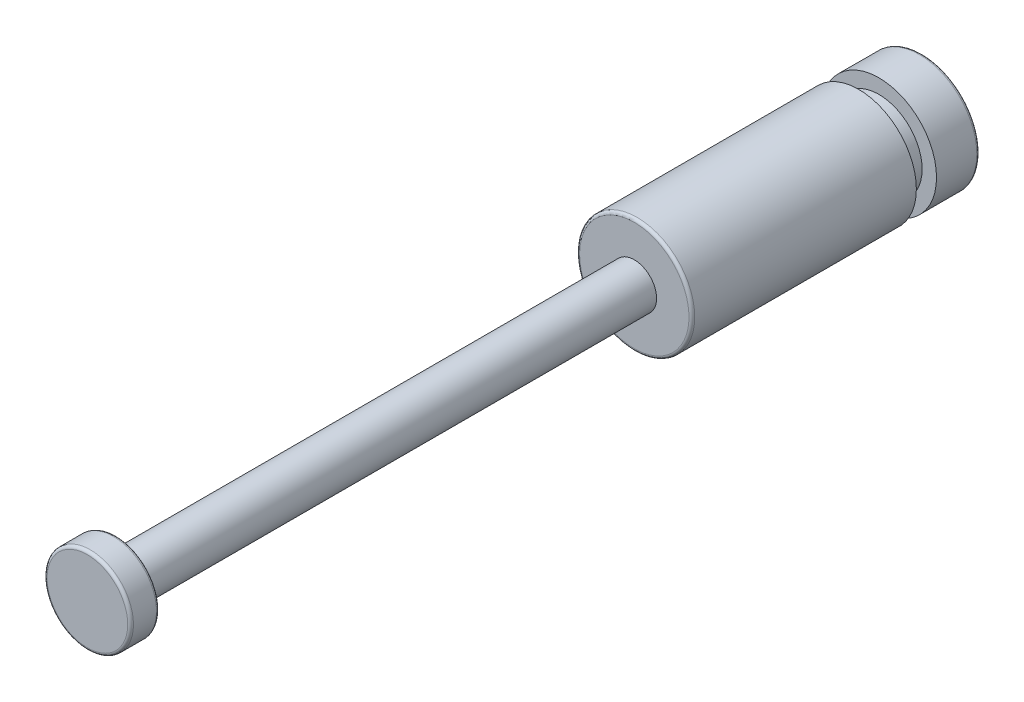
ISO-10303-21;
HEADER;
FILE_DESCRIPTION(('STEP AP214'),'2;1');
FILE_NAME('part.step','',(''),(''),'','','');
FILE_SCHEMA(('AUTOMOTIVE_DESIGN { 1 0 10303 214 1 1 1 1 }'));
ENDSEC;
DATA;
#1=APPLICATION_CONTEXT('core data for automotive mechanical design processes');
#2=APPLICATION_PROTOCOL_DEFINITION('international standard','automotive_design',2000,#1);
#3=PRODUCT_CONTEXT('',#1,'mechanical');
#4=PRODUCT('Part','Part','',(#3));
#5=PRODUCT_RELATED_PRODUCT_CATEGORY('part','',(#4));
#6=PRODUCT_DEFINITION_FORMATION('','',#4);
#7=PRODUCT_DEFINITION_CONTEXT('part definition',#1,'design');
#8=PRODUCT_DEFINITION('design','',#6,#7);
#9=PRODUCT_DEFINITION_SHAPE('','',#8);
#10=(LENGTH_UNIT() NAMED_UNIT(*) SI_UNIT(.MILLI.,.METRE.));
#11=(NAMED_UNIT(*) PLANE_ANGLE_UNIT() SI_UNIT($,.RADIAN.));
#12=(NAMED_UNIT(*) SI_UNIT($,.STERADIAN.) SOLID_ANGLE_UNIT());
#13=UNCERTAINTY_MEASURE_WITH_UNIT(LENGTH_MEASURE(1.E-05),#10,'distance_accuracy_value','');
#14=(GEOMETRIC_REPRESENTATION_CONTEXT(3) GLOBAL_UNCERTAINTY_ASSIGNED_CONTEXT((#13)) GLOBAL_UNIT_ASSIGNED_CONTEXT((#10,
#11,#12)) REPRESENTATION_CONTEXT('',''));
#15=CARTESIAN_POINT('',(0.,0.,0.));
#16=DIRECTION('',(0.,0.,1.));
#17=DIRECTION('',(1.,0.,0.));
#18=AXIS2_PLACEMENT_3D('',#15,#16,#17);
#19=CARTESIAN_POINT('',(0.,0.,-10.));
#20=DIRECTION('',(0.,0.,1.));
#21=DIRECTION('',(1.,0.,0.));
#22=AXIS2_PLACEMENT_3D('',#19,#20,#21);
#23=CYLINDRICAL_SURFACE('',#22,2.);
#24=CARTESIAN_POINT('',(0.,0.,-0.0999999999999994));
#25=DIRECTION('',(0.,0.,-1.));
#26=DIRECTION('',(-1.,0.,0.));
#27=AXIS2_PLACEMENT_3D('',#24,#25,#26);
#28=CIRCLE('',#27,2.);
#29=CARTESIAN_POINT('',(-2.,0.,-0.0999999999999994));
#30=VERTEX_POINT('',#29);
#31=EDGE_CURVE('E56',#30,#30,#28,.T.);
#32=ORIENTED_EDGE('',*,*,#31,.T.);
#33=EDGE_LOOP('',(#32));
#34=FACE_BOUND('',#33,.T.);
#35=CARTESIAN_POINT('',(0.,0.,-7.8));
#36=DIRECTION('',(0.,0.,1.));
#37=DIRECTION('',(1.,0.,0.));
#38=AXIS2_PLACEMENT_3D('',#35,#36,#37);
#39=CIRCLE('',#38,2.);
#40=CARTESIAN_POINT('',(2.,0.,-7.8));
#41=VERTEX_POINT('',#40);
#42=EDGE_CURVE('E94',#41,#41,#39,.T.);
#43=ORIENTED_EDGE('',*,*,#42,.T.);
#44=EDGE_LOOP('',(#43));
#45=FACE_BOUND('',#44,.T.);
#46=ADVANCED_FACE('F34',(#34,#45),#23,.T.);
#47=CARTESIAN_POINT('',(0.,0.,18.));
#48=DIRECTION('',(0.,0.,-1.));
#49=DIRECTION('',(-1.,0.,0.));
#50=AXIS2_PLACEMENT_3D('',#47,#48,#49);
#51=CYLINDRICAL_SURFACE('',#50,0.775000000000001);
#52=CARTESIAN_POINT('',(0.,0.,18.));
#53=DIRECTION('',(0.,0.,1.));
#54=DIRECTION('',(1.,0.,0.));
#55=AXIS2_PLACEMENT_3D('',#52,#53,#54);
#56=CIRCLE('',#55,0.775000000000001);
#57=CARTESIAN_POINT('',(0.775000000000001,0.,18.));
#58=VERTEX_POINT('',#57);
#59=EDGE_CURVE('E74',#58,#58,#56,.T.);
#60=ORIENTED_EDGE('',*,*,#59,.F.);
#61=EDGE_LOOP('',(#60));
#62=FACE_BOUND('',#61,.T.);
#63=CARTESIAN_POINT('',(0.,0.,0.));
#64=DIRECTION('',(0.,0.,-1.));
#65=DIRECTION('',(-1.,0.,0.));
#66=AXIS2_PLACEMENT_3D('',#63,#64,#65);
#67=CIRCLE('',#66,0.775000000000001);
#68=CARTESIAN_POINT('',(-0.775000000000001,0.,0.));
#69=VERTEX_POINT('',#68);
#70=EDGE_CURVE('E78',#69,#69,#67,.T.);
#71=ORIENTED_EDGE('',*,*,#70,.F.);
#72=EDGE_LOOP('',(#71));
#73=FACE_BOUND('',#72,.T.);
#74=ADVANCED_FACE('F118',(#62,#73),#51,.T.);
#75=CARTESIAN_POINT('',(0.,0.,18.));
#76=DIRECTION('',(0.,0.,1.));
#77=DIRECTION('',(1.,0.,0.));
#78=AXIS2_PLACEMENT_3D('',#75,#76,#77);
#79=PLANE('',#78);
#80=CARTESIAN_POINT('',(0.,0.,18.));
#81=DIRECTION('',(0.,0.,1.));
#82=DIRECTION('',(1.,0.,0.));
#83=AXIS2_PLACEMENT_3D('',#80,#81,#82);
#84=CIRCLE('',#83,1.4);
#85=CARTESIAN_POINT('',(1.4,0.,18.));
#86=VERTEX_POINT('',#85);
#87=EDGE_CURVE('E65',#86,#86,#84,.F.);
#88=ORIENTED_EDGE('',*,*,#87,.T.);
#89=EDGE_LOOP('',(#88));
#90=FACE_BOUND('',#89,.T.);
#91=ORIENTED_EDGE('',*,*,#59,.T.);
#92=EDGE_LOOP('',(#91));
#93=FACE_BOUND('',#92,.T.);
#94=ADVANCED_FACE('F125',(#90,#93),#79,.F.);
#95=CARTESIAN_POINT('',(0.,0.,19.));
#96=DIRECTION('',(0.,0.,-1.));
#97=DIRECTION('',(-1.,0.,0.));
#98=AXIS2_PLACEMENT_3D('',#95,#96,#97);
#99=CYLINDRICAL_SURFACE('',#98,1.5);
#100=CARTESIAN_POINT('',(0.,0.,18.1));
#101=DIRECTION('',(0.,0.,1.));
#102=DIRECTION('',(1.,0.,0.));
#103=AXIS2_PLACEMENT_3D('',#100,#101,#102);
#104=CIRCLE('',#103,1.5);
#105=CARTESIAN_POINT('',(1.5,0.,18.1));
#106=VERTEX_POINT('',#105);
#107=EDGE_CURVE('E68',#106,#106,#104,.T.);
#108=ORIENTED_EDGE('',*,*,#107,.T.);
#109=EDGE_LOOP('',(#108));
#110=FACE_BOUND('',#109,.T.);
#111=CARTESIAN_POINT('',(0.,0.,18.9));
#112=DIRECTION('',(0.,0.,1.));
#113=DIRECTION('',(1.,0.,0.));
#114=AXIS2_PLACEMENT_3D('',#111,#112,#113);
#115=CIRCLE('',#114,1.5);
#116=CARTESIAN_POINT('',(1.5,0.,18.9));
#117=VERTEX_POINT('',#116);
#118=EDGE_CURVE('E71',#117,#117,#115,.F.);
#119=ORIENTED_EDGE('',*,*,#118,.T.);
#120=EDGE_LOOP('',(#119));
#121=FACE_BOUND('',#120,.T.);
#122=ADVANCED_FACE('F234',(#110,#121),#99,.T.);
#123=CARTESIAN_POINT('',(0.,0.,19.));
#124=DIRECTION('',(0.,0.,1.));
#125=DIRECTION('',(1.,0.,0.));
#126=AXIS2_PLACEMENT_3D('',#123,#124,#125);
#127=PLANE('',#126);
#128=CARTESIAN_POINT('',(0.,0.,19.));
#129=DIRECTION('',(0.,0.,1.));
#130=DIRECTION('',(1.,0.,0.));
#131=AXIS2_PLACEMENT_3D('',#128,#129,#130);
#132=CIRCLE('',#131,1.4);
#133=CARTESIAN_POINT('',(1.4,0.,19.));
#134=VERTEX_POINT('',#133);
#135=EDGE_CURVE('E62',#134,#134,#132,.T.);
#136=ORIENTED_EDGE('',*,*,#135,.T.);
#137=EDGE_LOOP('',(#136));
#138=FACE_BOUND('',#137,.T.);
#139=ADVANCED_FACE('F113',(#138),#127,.T.);
#140=CARTESIAN_POINT('',(0.,0.,0.));
#141=DIRECTION('',(0.,0.,-1.));
#142=DIRECTION('',(-1.,0.,0.));
#143=AXIS2_PLACEMENT_3D('',#140,#141,#142);
#144=PLANE('',#143);
#145=CARTESIAN_POINT('',(0.,0.,0.));
#146=DIRECTION('',(0.,0.,-1.));
#147=DIRECTION('',(-1.,0.,0.));
#148=AXIS2_PLACEMENT_3D('',#145,#146,#147);
#149=CIRCLE('',#148,1.9);
#150=CARTESIAN_POINT('',(-1.9,0.,0.));
#151=VERTEX_POINT('',#150);
#152=EDGE_CURVE('E49',#151,#151,#149,.F.);
#153=ORIENTED_EDGE('',*,*,#152,.T.);
#154=EDGE_LOOP('',(#153));
#155=FACE_BOUND('',#154,.T.);
#156=ORIENTED_EDGE('',*,*,#70,.T.);
#157=EDGE_LOOP('',(#156));
#158=FACE_BOUND('',#157,.T.);
#159=ADVANCED_FACE('F103',(#155,#158),#144,.F.);
#160=CARTESIAN_POINT('',(0.,2.,-7.8));
#161=DIRECTION('',(0.,0.,-1.));
#162=DIRECTION('',(-1.,0.,0.));
#163=AXIS2_PLACEMENT_3D('',#160,#161,#162);
#164=PLANE('',#163);
#165=CARTESIAN_POINT('',(0.,0.,-7.8));
#166=DIRECTION('',(0.,0.,1.));
#167=DIRECTION('',(1.,0.,0.));
#168=AXIS2_PLACEMENT_3D('',#165,#166,#167);
#169=CIRCLE('',#168,1.5);
#170=CARTESIAN_POINT('',(1.5,0.,-7.8));
#171=VERTEX_POINT('',#170);
#172=EDGE_CURVE('E82',#171,#171,#169,.T.);
#173=ORIENTED_EDGE('',*,*,#172,.T.);
#174=EDGE_LOOP('',(#173));
#175=FACE_BOUND('',#174,.T.);
#176=ORIENTED_EDGE('',*,*,#42,.F.);
#177=EDGE_LOOP('',(#176));
#178=FACE_BOUND('',#177,.T.);
#179=ADVANCED_FACE('F100',(#175,#178),#164,.T.);
#180=CARTESIAN_POINT('',(0.,0.,0.));
#181=DIRECTION('',(0.,0.,1.));
#182=DIRECTION('',(1.,0.,0.));
#183=AXIS2_PLACEMENT_3D('',#180,#181,#182);
#184=CYLINDRICAL_SURFACE('',#183,1.5);
#185=CARTESIAN_POINT('',(0.,0.,-8.5));
#186=DIRECTION('',(0.,0.,1.));
#187=DIRECTION('',(1.,0.,0.));
#188=AXIS2_PLACEMENT_3D('',#185,#186,#187);
#189=CIRCLE('',#188,1.5);
#190=CARTESIAN_POINT('',(1.5,0.,-8.5));
#191=VERTEX_POINT('',#190);
#192=EDGE_CURVE('E86',#191,#191,#189,.T.);
#193=ORIENTED_EDGE('',*,*,#192,.T.);
#194=EDGE_LOOP('',(#193));
#195=FACE_BOUND('',#194,.T.);
#196=ORIENTED_EDGE('',*,*,#172,.F.);
#197=EDGE_LOOP('',(#196));
#198=FACE_BOUND('',#197,.T.);
#199=ADVANCED_FACE('F102',(#195,#198),#184,.T.);
#200=CARTESIAN_POINT('',(0.,2.,-8.5));
#201=DIRECTION('',(0.,0.,1.));
#202=DIRECTION('',(1.,0.,0.));
#203=AXIS2_PLACEMENT_3D('',#200,#201,#202);
#204=PLANE('',#203);
#205=CARTESIAN_POINT('',(0.,0.,-8.5));
#206=DIRECTION('',(0.,0.,1.));
#207=DIRECTION('',(1.,0.,0.));
#208=AXIS2_PLACEMENT_3D('',#205,#206,#207);
#209=CIRCLE('',#208,2.);
#210=CARTESIAN_POINT('',(2.,0.,-8.5));
#211=VERTEX_POINT('',#210);
#212=EDGE_CURVE('E90',#211,#211,#209,.T.);
#213=ORIENTED_EDGE('',*,*,#212,.T.);
#214=EDGE_LOOP('',(#213));
#215=FACE_BOUND('',#214,.T.);
#216=ORIENTED_EDGE('',*,*,#192,.F.);
#217=EDGE_LOOP('',(#216));
#218=FACE_BOUND('',#217,.T.);
#219=ADVANCED_FACE('F110',(#215,#218),#204,.T.);
#220=CARTESIAN_POINT('',(0.,0.,-10.));
#221=DIRECTION('',(0.,0.,-1.));
#222=DIRECTION('',(-1.,0.,0.));
#223=AXIS2_PLACEMENT_3D('',#220,#221,#222);
#224=PLANE('',#223);
#225=CARTESIAN_POINT('',(0.,0.,-10.));
#226=DIRECTION('',(0.,0.,-1.));
#227=DIRECTION('',(-1.,0.,0.));
#228=AXIS2_PLACEMENT_3D('',#225,#226,#227);
#229=CIRCLE('',#228,1.9);
#230=CARTESIAN_POINT('',(-1.9,0.,-10.));
#231=VERTEX_POINT('',#230);
#232=EDGE_CURVE('E42',#231,#231,#229,.T.);
#233=ORIENTED_EDGE('',*,*,#232,.T.);
#234=EDGE_LOOP('',(#233));
#235=FACE_BOUND('',#234,.T.);
#236=ADVANCED_FACE('F131',(#235),#224,.T.);
#237=CARTESIAN_POINT('',(0.,0.,-9.9));
#238=DIRECTION('',(0.,0.,-1.));
#239=DIRECTION('',(-1.,0.,0.));
#240=AXIS2_PLACEMENT_3D('',#237,#238,#239);
#241=CIRCLE('',#240,2.);
#242=CARTESIAN_POINT('',(-2.,0.,-9.9));
#243=VERTEX_POINT('',#242);
#244=EDGE_CURVE('E10',#243,#243,#241,.F.);
#245=ORIENTED_EDGE('',*,*,#244,.T.);
#246=EDGE_LOOP('',(#245));
#247=FACE_BOUND('',#246,.T.);
#248=ORIENTED_EDGE('',*,*,#212,.F.);
#249=EDGE_LOOP('',(#248));
#250=FACE_BOUND('',#249,.T.);
#251=ADVANCED_FACE('F121',(#247,#250),#23,.T.);
#252=CARTESIAN_POINT('',(0.,0.,18.1));
#253=DIRECTION('',(0.,0.,1.));
#254=DIRECTION('',(1.,0.,0.));
#255=AXIS2_PLACEMENT_3D('',#252,#253,#254);
#256=TOROIDAL_SURFACE('',#255,1.4,0.1);
#257=ORIENTED_EDGE('',*,*,#87,.F.);
#258=EDGE_LOOP('',(#257));
#259=FACE_BOUND('',#258,.T.);
#260=ORIENTED_EDGE('',*,*,#107,.F.);
#261=EDGE_LOOP('',(#260));
#262=FACE_BOUND('',#261,.T.);
#263=ADVANCED_FACE('F130',(#259,#262),#256,.T.);
#264=CARTESIAN_POINT('',(0.,0.,18.9));
#265=DIRECTION('',(0.,0.,1.));
#266=DIRECTION('',(1.,0.,0.));
#267=AXIS2_PLACEMENT_3D('',#264,#265,#266);
#268=TOROIDAL_SURFACE('',#267,1.4,0.1);
#269=ORIENTED_EDGE('',*,*,#118,.F.);
#270=EDGE_LOOP('',(#269));
#271=FACE_BOUND('',#270,.T.);
#272=ORIENTED_EDGE('',*,*,#135,.F.);
#273=EDGE_LOOP('',(#272));
#274=FACE_BOUND('',#273,.T.);
#275=ADVANCED_FACE('F136',(#271,#274),#268,.T.);
#276=CARTESIAN_POINT('',(0.,0.,-0.0999999999999994));
#277=DIRECTION('',(0.,0.,-1.));
#278=DIRECTION('',(-1.,0.,0.));
#279=AXIS2_PLACEMENT_3D('',#276,#277,#278);
#280=TOROIDAL_SURFACE('',#279,1.9,0.1);
#281=ORIENTED_EDGE('',*,*,#152,.F.);
#282=EDGE_LOOP('',(#281));
#283=FACE_BOUND('',#282,.T.);
#284=ORIENTED_EDGE('',*,*,#31,.F.);
#285=EDGE_LOOP('',(#284));
#286=FACE_BOUND('',#285,.T.);
#287=ADVANCED_FACE('F171',(#283,#286),#280,.T.);
#288=CARTESIAN_POINT('',(0.,0.,-9.9));
#289=DIRECTION('',(0.,0.,-1.));
#290=DIRECTION('',(-1.,0.,0.));
#291=AXIS2_PLACEMENT_3D('',#288,#289,#290);
#292=TOROIDAL_SURFACE('',#291,1.9,0.1);
#293=ORIENTED_EDGE('',*,*,#244,.F.);
#294=EDGE_LOOP('',(#293));
#295=FACE_BOUND('',#294,.T.);
#296=ORIENTED_EDGE('',*,*,#232,.F.);
#297=EDGE_LOOP('',(#296));
#298=FACE_BOUND('',#297,.T.);
#299=ADVANCED_FACE('F36',(#295,#298),#292,.T.);
#300=CLOSED_SHELL('',(#46,#74,#94,#122,#139,#159,#179,#199,#219,#236,#251,#263,#275,#287,#299));
#301=MANIFOLD_SOLID_BREP('B2',#300);
#302=ADVANCED_BREP_SHAPE_REPRESENTATION('',(#18,#301),#14);
#303=SHAPE_DEFINITION_REPRESENTATION(#9,#302);
ENDSEC;
END-ISO-10303-21;
